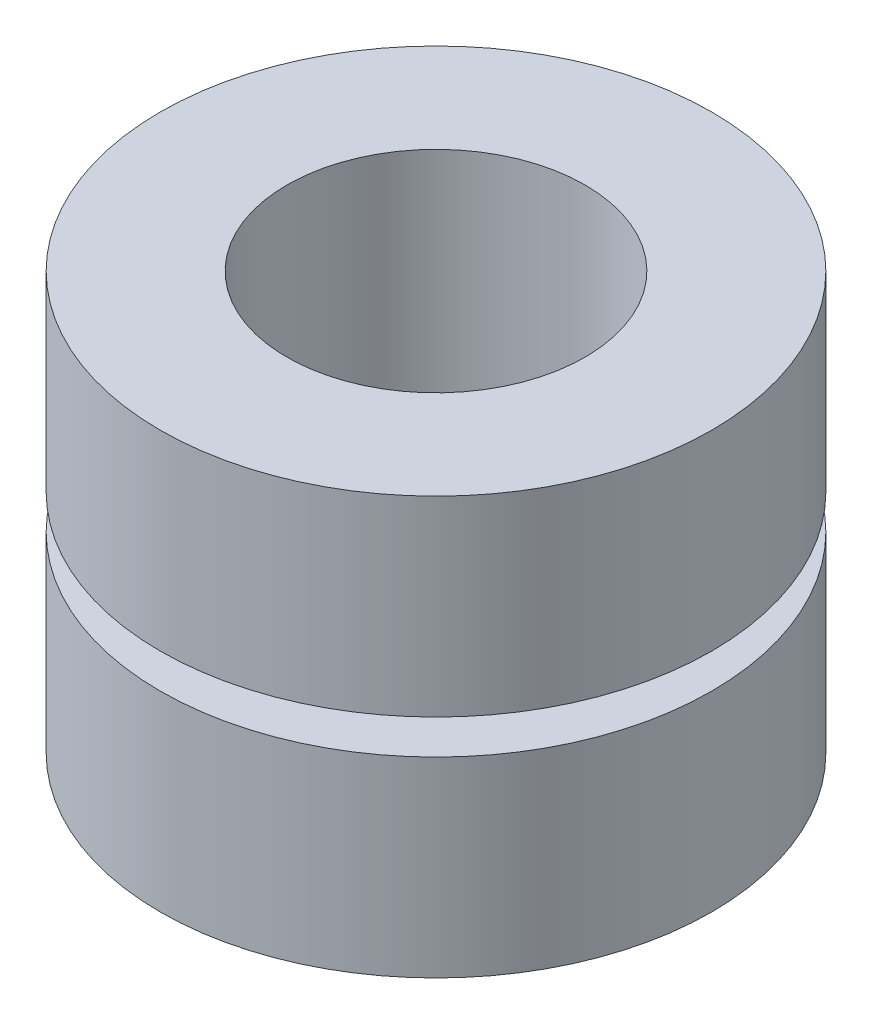
ISO-10303-21;
HEADER;
FILE_DESCRIPTION(('STEP AP214'),'2;1');
FILE_NAME('part.step','',(''),(''),'','','');
FILE_SCHEMA(('AUTOMOTIVE_DESIGN { 1 0 10303 214 1 1 1 1 }'));
ENDSEC;
DATA;
#1=APPLICATION_CONTEXT('core data for automotive mechanical design processes');
#2=APPLICATION_PROTOCOL_DEFINITION('international standard','automotive_design',2000,#1);
#3=PRODUCT_CONTEXT('',#1,'mechanical');
#4=PRODUCT('Part','Part','',(#3));
#5=PRODUCT_RELATED_PRODUCT_CATEGORY('part','',(#4));
#6=PRODUCT_DEFINITION_FORMATION('','',#4);
#7=PRODUCT_DEFINITION_CONTEXT('part definition',#1,'design');
#8=PRODUCT_DEFINITION('design','',#6,#7);
#9=PRODUCT_DEFINITION_SHAPE('','',#8);
#10=(LENGTH_UNIT() NAMED_UNIT(*) SI_UNIT(.MILLI.,.METRE.));
#11=(NAMED_UNIT(*) PLANE_ANGLE_UNIT() SI_UNIT($,.RADIAN.));
#12=(NAMED_UNIT(*) SI_UNIT($,.STERADIAN.) SOLID_ANGLE_UNIT());
#13=UNCERTAINTY_MEASURE_WITH_UNIT(LENGTH_MEASURE(1.E-05),#10,'distance_accuracy_value','');
#14=(GEOMETRIC_REPRESENTATION_CONTEXT(3) GLOBAL_UNCERTAINTY_ASSIGNED_CONTEXT((#13)) GLOBAL_UNIT_ASSIGNED_CONTEXT((#10,
#11,#12)) REPRESENTATION_CONTEXT('',''));
#15=CARTESIAN_POINT('',(0.,0.,0.));
#16=DIRECTION('',(0.,0.,1.));
#17=DIRECTION('',(1.,0.,0.));
#18=AXIS2_PLACEMENT_3D('',#15,#16,#17);
#19=CARTESIAN_POINT('',(2.5146,0.,0.));
#20=DIRECTION('',(0.,-1.,0.));
#21=DIRECTION('',(0.,0.,-1.));
#22=AXIS2_PLACEMENT_3D('',#19,#20,#21);
#23=PLANE('',#22);
#24=CARTESIAN_POINT('',(0.,0.,0.));
#25=DIRECTION('',(0.,-1.,0.));
#26=DIRECTION('',(0.,0.,-1.));
#27=AXIS2_PLACEMENT_3D('',#24,#25,#26);
#28=CIRCLE('',#27,4.6482);
#29=CARTESIAN_POINT('',(0.,0.,-4.6482));
#30=VERTEX_POINT('',#29);
#31=EDGE_CURVE('E10',#30,#30,#28,.T.);
#32=ORIENTED_EDGE('',*,*,#31,.T.);
#33=EDGE_LOOP('',(#32));
#34=FACE_BOUND('',#33,.T.);
#35=CARTESIAN_POINT('',(0.,0.,0.));
#36=DIRECTION('',(0.,-1.,0.));
#37=DIRECTION('',(0.,0.,-1.));
#38=AXIS2_PLACEMENT_3D('',#35,#36,#37);
#39=CIRCLE('',#38,2.5146);
#40=CARTESIAN_POINT('',(0.,0.,-2.5146));
#41=VERTEX_POINT('',#40);
#42=EDGE_CURVE('E62',#41,#41,#39,.T.);
#43=ORIENTED_EDGE('',*,*,#42,.F.);
#44=EDGE_LOOP('',(#43));
#45=FACE_BOUND('',#44,.T.);
#46=ADVANCED_FACE('F34',(#34,#45),#23,.T.);
#47=CARTESIAN_POINT('',(0.,0.,0.));
#48=DIRECTION('',(0.,-1.,0.));
#49=DIRECTION('',(0.,0.,-1.));
#50=AXIS2_PLACEMENT_3D('',#47,#48,#49);
#51=CYLINDRICAL_SURFACE('',#50,4.6482);
#52=CARTESIAN_POINT('',(0.,3.2258,0.));
#53=DIRECTION('',(0.,-1.,0.));
#54=DIRECTION('',(0.,0.,-1.));
#55=AXIS2_PLACEMENT_3D('',#52,#53,#54);
#56=CIRCLE('',#55,4.6482);
#57=CARTESIAN_POINT('',(0.,3.2258,-4.6482));
#58=VERTEX_POINT('',#57);
#59=EDGE_CURVE('E40',#58,#58,#56,.T.);
#60=ORIENTED_EDGE('',*,*,#59,.T.);
#61=EDGE_LOOP('',(#60));
#62=FACE_BOUND('',#61,.T.);
#63=ORIENTED_EDGE('',*,*,#31,.F.);
#64=EDGE_LOOP('',(#63));
#65=FACE_BOUND('',#64,.T.);
#66=ADVANCED_FACE('F70',(#62,#65),#51,.T.);
#67=CARTESIAN_POINT('',(2.8194,3.2258,0.));
#68=DIRECTION('',(0.,1.,0.));
#69=DIRECTION('',(0.,0.,1.));
#70=AXIS2_PLACEMENT_3D('',#67,#68,#69);
#71=PLANE('',#70);
#72=CARTESIAN_POINT('',(0.,3.2258,0.));
#73=DIRECTION('',(0.,-1.,0.));
#74=DIRECTION('',(0.,0.,-1.));
#75=AXIS2_PLACEMENT_3D('',#72,#73,#74);
#76=CIRCLE('',#75,2.8194);
#77=CARTESIAN_POINT('',(0.,3.2258,-2.8194));
#78=VERTEX_POINT('',#77);
#79=EDGE_CURVE('E44',#78,#78,#76,.T.);
#80=ORIENTED_EDGE('',*,*,#79,.T.);
#81=EDGE_LOOP('',(#80));
#82=FACE_BOUND('',#81,.T.);
#83=ORIENTED_EDGE('',*,*,#59,.F.);
#84=EDGE_LOOP('',(#83));
#85=FACE_BOUND('',#84,.T.);
#86=ADVANCED_FACE('F74',(#82,#85),#71,.T.);
#87=CARTESIAN_POINT('',(0.,0.,0.));
#88=DIRECTION('',(0.,-1.,0.));
#89=DIRECTION('',(0.,0.,-1.));
#90=AXIS2_PLACEMENT_3D('',#87,#88,#89);
#91=CYLINDRICAL_SURFACE('',#90,2.8194);
#92=CARTESIAN_POINT('',(0.,3.81,0.));
#93=DIRECTION('',(0.,-1.,0.));
#94=DIRECTION('',(0.,0.,-1.));
#95=AXIS2_PLACEMENT_3D('',#92,#93,#94);
#96=CIRCLE('',#95,2.8194);
#97=CARTESIAN_POINT('',(0.,3.81,-2.8194));
#98=VERTEX_POINT('',#97);
#99=EDGE_CURVE('E48',#98,#98,#96,.T.);
#100=ORIENTED_EDGE('',*,*,#99,.T.);
#101=EDGE_LOOP('',(#100));
#102=FACE_BOUND('',#101,.T.);
#103=ORIENTED_EDGE('',*,*,#79,.F.);
#104=EDGE_LOOP('',(#103));
#105=FACE_BOUND('',#104,.T.);
#106=ADVANCED_FACE('F78',(#102,#105),#91,.T.);
#107=CARTESIAN_POINT('',(4.6482,3.81,0.));
#108=DIRECTION('',(0.,-1.,0.));
#109=DIRECTION('',(0.,0.,-1.));
#110=AXIS2_PLACEMENT_3D('',#107,#108,#109);
#111=PLANE('',#110);
#112=CARTESIAN_POINT('',(0.,3.81,0.));
#113=DIRECTION('',(0.,-1.,0.));
#114=DIRECTION('',(0.,0.,-1.));
#115=AXIS2_PLACEMENT_3D('',#112,#113,#114);
#116=CIRCLE('',#115,4.6482);
#117=CARTESIAN_POINT('',(0.,3.81,-4.6482));
#118=VERTEX_POINT('',#117);
#119=EDGE_CURVE('E53',#118,#118,#116,.T.);
#120=ORIENTED_EDGE('',*,*,#119,.T.);
#121=EDGE_LOOP('',(#120));
#122=FACE_BOUND('',#121,.T.);
#123=ORIENTED_EDGE('',*,*,#99,.F.);
#124=EDGE_LOOP('',(#123));
#125=FACE_BOUND('',#124,.T.);
#126=ADVANCED_FACE('F85',(#122,#125),#111,.T.);
#127=CARTESIAN_POINT('',(0.,0.,0.));
#128=DIRECTION('',(0.,-1.,0.));
#129=DIRECTION('',(0.,0.,-1.));
#130=AXIS2_PLACEMENT_3D('',#127,#128,#129);
#131=CYLINDRICAL_SURFACE('',#130,4.6482);
#132=CARTESIAN_POINT('',(0.,7.0358,0.));
#133=DIRECTION('',(0.,-1.,0.));
#134=DIRECTION('',(0.,0.,-1.));
#135=AXIS2_PLACEMENT_3D('',#132,#133,#134);
#136=CIRCLE('',#135,4.6482);
#137=CARTESIAN_POINT('',(0.,7.0358,-4.6482));
#138=VERTEX_POINT('',#137);
#139=EDGE_CURVE('E56',#138,#138,#136,.T.);
#140=ORIENTED_EDGE('',*,*,#139,.T.);
#141=EDGE_LOOP('',(#140));
#142=FACE_BOUND('',#141,.T.);
#143=ORIENTED_EDGE('',*,*,#119,.F.);
#144=EDGE_LOOP('',(#143));
#145=FACE_BOUND('',#144,.T.);
#146=ADVANCED_FACE('F89',(#142,#145),#131,.T.);
#147=CARTESIAN_POINT('',(2.5146,7.0358,0.));
#148=DIRECTION('',(0.,1.,0.));
#149=DIRECTION('',(0.,0.,1.));
#150=AXIS2_PLACEMENT_3D('',#147,#148,#149);
#151=PLANE('',#150);
#152=CARTESIAN_POINT('',(0.,7.0358,0.));
#153=DIRECTION('',(0.,-1.,0.));
#154=DIRECTION('',(0.,0.,-1.));
#155=AXIS2_PLACEMENT_3D('',#152,#153,#154);
#156=CIRCLE('',#155,2.5146);
#157=CARTESIAN_POINT('',(0.,7.0358,-2.5146));
#158=VERTEX_POINT('',#157);
#159=EDGE_CURVE('E59',#158,#158,#156,.T.);
#160=ORIENTED_EDGE('',*,*,#159,.T.);
#161=EDGE_LOOP('',(#160));
#162=FACE_BOUND('',#161,.T.);
#163=ORIENTED_EDGE('',*,*,#139,.F.);
#164=EDGE_LOOP('',(#163));
#165=FACE_BOUND('',#164,.T.);
#166=ADVANCED_FACE('F93',(#162,#165),#151,.T.);
#167=CARTESIAN_POINT('',(0.,0.,0.));
#168=DIRECTION('',(0.,-1.,0.));
#169=DIRECTION('',(0.,0.,-1.));
#170=AXIS2_PLACEMENT_3D('',#167,#168,#169);
#171=CYLINDRICAL_SURFACE('',#170,2.5146);
#172=ORIENTED_EDGE('',*,*,#42,.T.);
#173=EDGE_LOOP('',(#172));
#174=FACE_BOUND('',#173,.T.);
#175=ORIENTED_EDGE('',*,*,#159,.F.);
#176=EDGE_LOOP('',(#175));
#177=FACE_BOUND('',#176,.T.);
#178=ADVANCED_FACE('F66',(#174,#177),#171,.F.);
#179=CLOSED_SHELL('',(#46,#66,#86,#106,#126,#146,#166,#178));
#180=MANIFOLD_SOLID_BREP('B2',#179);
#181=ADVANCED_BREP_SHAPE_REPRESENTATION('',(#18,#180),#14);
#182=SHAPE_DEFINITION_REPRESENTATION(#9,#181);
ENDSEC;
END-ISO-10303-21;
